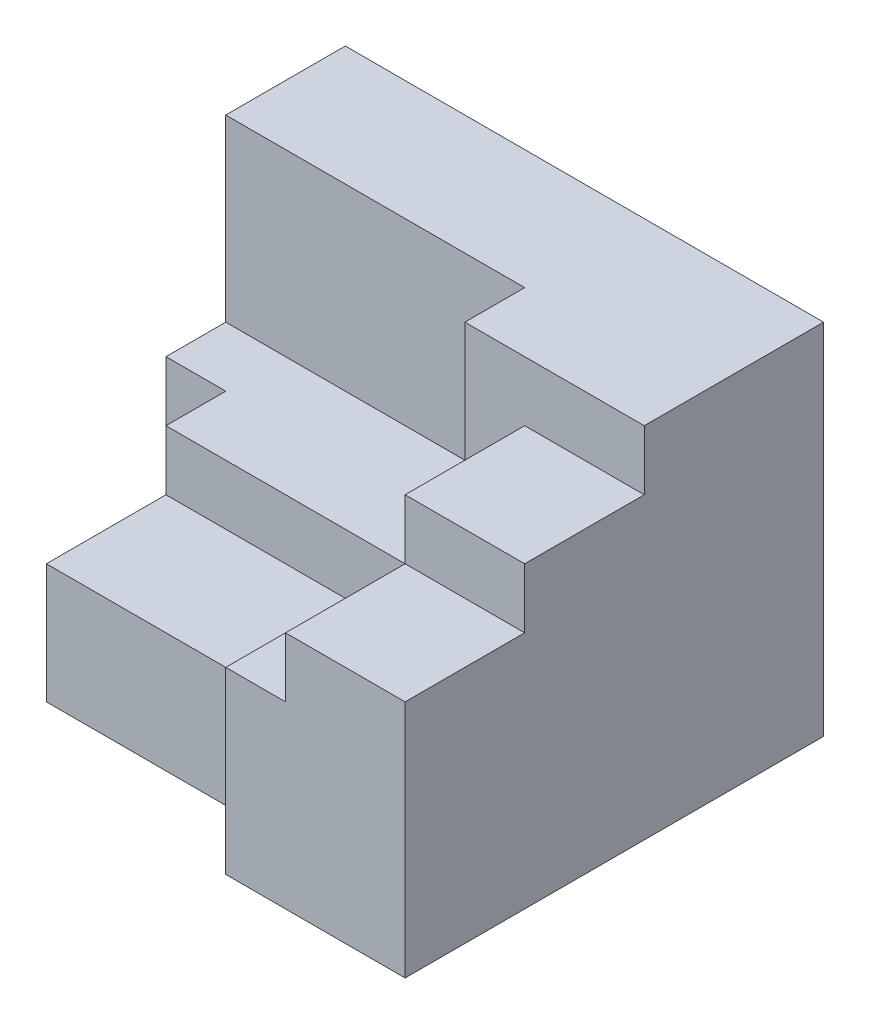
ISO-10303-21;
HEADER;
FILE_DESCRIPTION(('STEP AP214'),'2;1');
FILE_NAME('part.step','',(''),(''),'','','');
FILE_SCHEMA(('AUTOMOTIVE_DESIGN { 1 0 10303 214 1 1 1 1 }'));
ENDSEC;
DATA;
#1=APPLICATION_CONTEXT('core data for automotive mechanical design processes');
#2=APPLICATION_PROTOCOL_DEFINITION('international standard','automotive_design',2000,#1);
#3=PRODUCT_CONTEXT('',#1,'mechanical');
#4=PRODUCT('Part','Part','',(#3));
#5=PRODUCT_RELATED_PRODUCT_CATEGORY('part','',(#4));
#6=PRODUCT_DEFINITION_FORMATION('','',#4);
#7=PRODUCT_DEFINITION_CONTEXT('part definition',#1,'design');
#8=PRODUCT_DEFINITION('design','',#6,#7);
#9=PRODUCT_DEFINITION_SHAPE('','',#8);
#10=(LENGTH_UNIT() NAMED_UNIT(*) SI_UNIT(.MILLI.,.METRE.));
#11=(NAMED_UNIT(*) PLANE_ANGLE_UNIT() SI_UNIT($,.RADIAN.));
#12=(NAMED_UNIT(*) SI_UNIT($,.STERADIAN.) SOLID_ANGLE_UNIT());
#13=UNCERTAINTY_MEASURE_WITH_UNIT(LENGTH_MEASURE(1.E-05),#10,'distance_accuracy_value','');
#14=(GEOMETRIC_REPRESENTATION_CONTEXT(3) GLOBAL_UNCERTAINTY_ASSIGNED_CONTEXT((#13)) GLOBAL_UNIT_ASSIGNED_CONTEXT((#10,
#11,#12)) REPRESENTATION_CONTEXT('',''));
#15=CARTESIAN_POINT('',(0.,0.,0.));
#16=DIRECTION('',(0.,0.,1.));
#17=DIRECTION('',(1.,0.,0.));
#18=AXIS2_PLACEMENT_3D('',#15,#16,#17);
#19=CARTESIAN_POINT('',(-4.,6.,3.50000000000002));
#20=DIRECTION('',(0.,0.,-1.));
#21=DIRECTION('',(-1.,0.,0.));
#22=AXIS2_PLACEMENT_3D('',#19,#20,#21);
#23=PLANE('',#22);
#24=DIRECTION('',(0.,-1.,0.));
#25=VECTOR('',#24,1.);
#26=CARTESIAN_POINT('',(4.,6.,3.50000000000002));
#27=LINE('',#26,#25);
#28=CARTESIAN_POINT('',(4.,4.,3.50000000000002));
#29=VERTEX_POINT('',#28);
#30=CARTESIAN_POINT('',(4.,0.,3.50000000000002));
#31=VERTEX_POINT('',#30);
#32=EDGE_CURVE('E175',#29,#31,#27,.T.);
#33=ORIENTED_EDGE('',*,*,#32,.F.);
#34=DIRECTION('',(1.,0.,0.));
#35=VECTOR('',#34,1.);
#36=CARTESIAN_POINT('',(2.,4.,3.50000000000002));
#37=LINE('',#36,#35);
#38=CARTESIAN_POINT('',(2.,4.,3.50000000000002));
#39=VERTEX_POINT('',#38);
#40=EDGE_CURVE('E161',#39,#29,#37,.T.);
#41=ORIENTED_EDGE('',*,*,#40,.F.);
#42=DIRECTION('',(0.,-1.,0.));
#43=VECTOR('',#42,1.);
#44=CARTESIAN_POINT('',(2.,6.,3.50000000000002));
#45=LINE('',#44,#43);
#46=CARTESIAN_POINT('',(2.,3.,3.50000000000002));
#47=VERTEX_POINT('',#46);
#48=EDGE_CURVE('E172',#39,#47,#45,.T.);
#49=ORIENTED_EDGE('',*,*,#48,.T.);
#50=DIRECTION('',(-1.,0.,0.));
#51=VECTOR('',#50,1.);
#52=CARTESIAN_POINT('',(-4.,3.,3.50000000000002));
#53=LINE('',#52,#51);
#54=CARTESIAN_POINT('',(1.,3.,3.50000000000002));
#55=VERTEX_POINT('',#54);
#56=EDGE_CURVE('E183',#47,#55,#53,.T.);
#57=ORIENTED_EDGE('',*,*,#56,.T.);
#58=DIRECTION('',(0.,1.,0.));
#59=VECTOR('',#58,1.);
#60=CARTESIAN_POINT('',(1.,-54.,3.50000000000002));
#61=LINE('',#60,#59);
#62=CARTESIAN_POINT('',(1.,0.,3.50000000000002));
#63=VERTEX_POINT('',#62);
#64=EDGE_CURVE('E182',#63,#55,#61,.T.);
#65=ORIENTED_EDGE('',*,*,#64,.F.);
#66=DIRECTION('',(1.,0.,0.));
#67=VECTOR('',#66,1.);
#68=CARTESIAN_POINT('',(-4.,0.,3.50000000000002));
#69=LINE('',#68,#67);
#70=EDGE_CURVE('E205',#63,#31,#69,.T.);
#71=ORIENTED_EDGE('',*,*,#70,.T.);
#72=EDGE_LOOP('',(#33,#41,#49,#57,#65,#71));
#73=FACE_BOUND('',#72,.T.);
#74=ADVANCED_FACE('F33',(#73),#23,.F.);
#75=CARTESIAN_POINT('',(2.,3.,-0.499999999999989));
#76=DIRECTION('',(1.,0.,0.));
#77=DIRECTION('',(0.,0.,-1.));
#78=AXIS2_PLACEMENT_3D('',#75,#76,#77);
#79=PLANE('',#78);
#80=DIRECTION('',(0.,0.,1.));
#81=VECTOR('',#80,1.);
#82=CARTESIAN_POINT('',(2.,4.,3.50000000000002));
#83=LINE('',#82,#81);
#84=CARTESIAN_POINT('',(2.,4.,1.50000000000002));
#85=VERTEX_POINT('',#84);
#86=EDGE_CURVE('E158',#85,#39,#83,.T.);
#87=ORIENTED_EDGE('',*,*,#86,.F.);
#88=DIRECTION('',(0.,1.,0.));
#89=VECTOR('',#88,1.);
#90=CARTESIAN_POINT('',(2.,4.,1.50000000000002));
#91=LINE('',#90,#89);
#92=CARTESIAN_POINT('',(2.,5.,1.50000000000002));
#93=VERTEX_POINT('',#92);
#94=EDGE_CURVE('E494',#85,#93,#91,.T.);
#95=ORIENTED_EDGE('',*,*,#94,.T.);
#96=DIRECTION('',(0.,0.,1.));
#97=VECTOR('',#96,1.);
#98=CARTESIAN_POINT('',(2.,5.,-0.499999999999989));
#99=LINE('',#98,#97);
#100=CARTESIAN_POINT('',(2.,5.,-0.499999999999989));
#101=VERTEX_POINT('',#100);
#102=EDGE_CURVE('E489',#101,#93,#99,.T.);
#103=ORIENTED_EDGE('',*,*,#102,.F.);
#104=DIRECTION('',(0.,1.,0.));
#105=VECTOR('',#104,1.);
#106=CARTESIAN_POINT('',(2.,3.,-0.499999999999989));
#107=LINE('',#106,#105);
#108=CARTESIAN_POINT('',(2.,3.,-0.499999999999989));
#109=VERTEX_POINT('',#108);
#110=EDGE_CURVE('E290',#109,#101,#107,.T.);
#111=ORIENTED_EDGE('',*,*,#110,.F.);
#112=DIRECTION('',(0.,0.,-1.));
#113=VECTOR('',#112,1.);
#114=CARTESIAN_POINT('',(2.,3.,-0.499999999999989));
#115=LINE('',#114,#113);
#116=EDGE_CURVE('E181',#47,#109,#115,.T.);
#117=ORIENTED_EDGE('',*,*,#116,.F.);
#118=ORIENTED_EDGE('',*,*,#48,.F.);
#119=EDGE_LOOP('',(#87,#95,#103,#111,#117,#118));
#120=FACE_BOUND('',#119,.T.);
#121=ADVANCED_FACE('F179',(#120),#79,.F.);
#122=CARTESIAN_POINT('',(4.,6.,3.50000000000002));
#123=DIRECTION('',(-1.,0.,0.));
#124=DIRECTION('',(0.,0.,1.));
#125=AXIS2_PLACEMENT_3D('',#122,#123,#124);
#126=PLANE('',#125);
#127=DIRECTION('',(0.,0.,-1.));
#128=VECTOR('',#127,1.);
#129=CARTESIAN_POINT('',(4.,5.,3.50000000000002));
#130=LINE('',#129,#128);
#131=CARTESIAN_POINT('',(4.,5.,1.50000000000002));
#132=VERTEX_POINT('',#131);
#133=CARTESIAN_POINT('',(4.,5.,-0.499999999999989));
#134=VERTEX_POINT('',#133);
#135=EDGE_CURVE('E486',#132,#134,#130,.T.);
#136=ORIENTED_EDGE('',*,*,#135,.F.);
#137=DIRECTION('',(0.,1.,0.));
#138=VECTOR('',#137,1.);
#139=CARTESIAN_POINT('',(4.,4.,1.50000000000002));
#140=LINE('',#139,#138);
#141=CARTESIAN_POINT('',(4.,4.,1.50000000000002));
#142=VERTEX_POINT('',#141);
#143=EDGE_CURVE('E48',#142,#132,#140,.T.);
#144=ORIENTED_EDGE('',*,*,#143,.F.);
#145=DIRECTION('',(0.,0.,-1.));
#146=VECTOR('',#145,1.);
#147=CARTESIAN_POINT('',(4.,4.,3.50000000000002));
#148=LINE('',#147,#146);
#149=EDGE_CURVE('E176',#29,#142,#148,.T.);
#150=ORIENTED_EDGE('',*,*,#149,.F.);
#151=ORIENTED_EDGE('',*,*,#32,.T.);
#152=DIRECTION('',(0.,0.,-1.));
#153=VECTOR('',#152,1.);
#154=CARTESIAN_POINT('',(4.,0.,3.50000000000002));
#155=LINE('',#154,#153);
#156=CARTESIAN_POINT('',(4.,0.,-3.49999999999999));
#157=VERTEX_POINT('',#156);
#158=EDGE_CURVE('E194',#31,#157,#155,.T.);
#159=ORIENTED_EDGE('',*,*,#158,.T.);
#160=DIRECTION('',(0.,-1.,0.));
#161=VECTOR('',#160,1.);
#162=CARTESIAN_POINT('',(4.,6.,-3.49999999999999));
#163=LINE('',#162,#161);
#164=CARTESIAN_POINT('',(4.,6.,-3.49999999999999));
#165=VERTEX_POINT('',#164);
#166=EDGE_CURVE('E222',#165,#157,#163,.T.);
#167=ORIENTED_EDGE('',*,*,#166,.F.);
#168=DIRECTION('',(0.,0.,-1.));
#169=VECTOR('',#168,1.);
#170=CARTESIAN_POINT('',(4.,6.,3.50000000000002));
#171=LINE('',#170,#169);
#172=CARTESIAN_POINT('',(4.,6.,-0.499999999999989));
#173=VERTEX_POINT('',#172);
#174=EDGE_CURVE('E202',#173,#165,#171,.T.);
#175=ORIENTED_EDGE('',*,*,#174,.F.);
#176=DIRECTION('',(0.,-1.,0.));
#177=VECTOR('',#176,1.);
#178=CARTESIAN_POINT('',(4.,6.,-0.499999999999989));
#179=LINE('',#178,#177);
#180=EDGE_CURVE('E263',#173,#134,#179,.T.);
#181=ORIENTED_EDGE('',*,*,#180,.T.);
#182=EDGE_LOOP('',(#136,#144,#150,#151,#159,#167,#175,#181));
#183=FACE_BOUND('',#182,.T.);
#184=ADVANCED_FACE('F35',(#183),#126,.F.);
#185=CARTESIAN_POINT('',(-4.,6.,-3.49999999999999));
#186=DIRECTION('',(0.,0.,1.));
#187=DIRECTION('',(1.,0.,0.));
#188=AXIS2_PLACEMENT_3D('',#185,#186,#187);
#189=PLANE('',#188);
#190=DIRECTION('',(-1.,0.,0.));
#191=VECTOR('',#190,1.);
#192=CARTESIAN_POINT('',(-4.,0.,-3.49999999999999));
#193=LINE('',#192,#191);
#194=CARTESIAN_POINT('',(-4.,0.,-3.49999999999999));
#195=VERTEX_POINT('',#194);
#196=EDGE_CURVE('E212',#157,#195,#193,.T.);
#197=ORIENTED_EDGE('',*,*,#196,.T.);
#198=DIRECTION('',(0.,-1.,0.));
#199=VECTOR('',#198,1.);
#200=CARTESIAN_POINT('',(-4.,6.,-3.49999999999999));
#201=LINE('',#200,#199);
#202=CARTESIAN_POINT('',(-4.,6.,-3.49999999999999));
#203=VERTEX_POINT('',#202);
#204=EDGE_CURVE('E219',#203,#195,#201,.T.);
#205=ORIENTED_EDGE('',*,*,#204,.F.);
#206=DIRECTION('',(-1.,0.,0.));
#207=VECTOR('',#206,1.);
#208=CARTESIAN_POINT('',(-4.,6.,-3.49999999999999));
#209=LINE('',#208,#207);
#210=EDGE_CURVE('E204',#165,#203,#209,.T.);
#211=ORIENTED_EDGE('',*,*,#210,.F.);
#212=ORIENTED_EDGE('',*,*,#166,.T.);
#213=EDGE_LOOP('',(#197,#205,#211,#212));
#214=FACE_BOUND('',#213,.T.);
#215=ADVANCED_FACE('F316',(#214),#189,.F.);
#216=CARTESIAN_POINT('',(-4.,6.,3.50000000000002));
#217=DIRECTION('',(1.,0.,0.));
#218=DIRECTION('',(0.,0.,-1.));
#219=AXIS2_PLACEMENT_3D('',#216,#217,#218);
#220=PLANE('',#219);
#221=DIRECTION('',(0.,0.,1.));
#222=VECTOR('',#221,1.);
#223=CARTESIAN_POINT('',(-4.,3.,3.68950832365466));
#224=LINE('',#223,#222);
#225=CARTESIAN_POINT('',(-4.,3.,-1.49999999999999));
#226=VERTEX_POINT('',#225);
#227=CARTESIAN_POINT('',(-4.,3.,-0.499999999999984));
#228=VERTEX_POINT('',#227);
#229=EDGE_CURVE('E277',#226,#228,#224,.T.);
#230=ORIENTED_EDGE('',*,*,#229,.F.);
#231=DIRECTION('',(0.,1.,0.));
#232=VECTOR('',#231,1.);
#233=CARTESIAN_POINT('',(-4.,3.,-1.49999999999999));
#234=LINE('',#233,#232);
#235=CARTESIAN_POINT('',(-4.,6.,-1.49999999999999));
#236=VERTEX_POINT('',#235);
#237=EDGE_CURVE('E297',#226,#236,#234,.T.);
#238=ORIENTED_EDGE('',*,*,#237,.T.);
#239=DIRECTION('',(0.,0.,1.));
#240=VECTOR('',#239,1.);
#241=CARTESIAN_POINT('',(-4.,6.,3.50000000000002));
#242=LINE('',#241,#240);
#243=EDGE_CURVE('E207',#203,#236,#242,.T.);
#244=ORIENTED_EDGE('',*,*,#243,.F.);
#245=ORIENTED_EDGE('',*,*,#204,.T.);
#246=DIRECTION('',(0.,0.,1.));
#247=VECTOR('',#246,1.);
#248=CARTESIAN_POINT('',(-4.,0.,3.50000000000002));
#249=LINE('',#248,#247);
#250=CARTESIAN_POINT('',(-4.,0.,-0.499999999999983));
#251=VERTEX_POINT('',#250);
#252=EDGE_CURVE('E214',#195,#251,#249,.T.);
#253=ORIENTED_EDGE('',*,*,#252,.T.);
#254=DIRECTION('',(0.,1.,0.));
#255=VECTOR('',#254,1.);
#256=CARTESIAN_POINT('',(-4.,-54.,-0.499999999999983));
#257=LINE('',#256,#255);
#258=EDGE_CURVE('E191',#251,#228,#257,.T.);
#259=ORIENTED_EDGE('',*,*,#258,.T.);
#260=EDGE_LOOP('',(#230,#238,#244,#245,#253,#259));
#261=FACE_BOUND('',#260,.T.);
#262=ADVANCED_FACE('F309',(#261),#220,.F.);
#263=CARTESIAN_POINT('',(0.,6.,0.));
#264=DIRECTION('',(0.,-1.,0.));
#265=DIRECTION('',(0.,0.,-1.));
#266=AXIS2_PLACEMENT_3D('',#263,#264,#265);
#267=PLANE('',#266);
#268=DIRECTION('',(-1.,0.,0.));
#269=VECTOR('',#268,1.);
#270=CARTESIAN_POINT('',(1.,6.,-0.499999999999989));
#271=LINE('',#270,#269);
#272=CARTESIAN_POINT('',(1.,6.,-0.499999999999989));
#273=VERTEX_POINT('',#272);
#274=EDGE_CURVE('E274',#173,#273,#271,.T.);
#275=ORIENTED_EDGE('',*,*,#274,.F.);
#276=ORIENTED_EDGE('',*,*,#174,.T.);
#277=ORIENTED_EDGE('',*,*,#210,.T.);
#278=ORIENTED_EDGE('',*,*,#243,.T.);
#279=DIRECTION('',(-1.,0.,0.));
#280=VECTOR('',#279,1.);
#281=CARTESIAN_POINT('',(-4.,6.,-1.49999999999999));
#282=LINE('',#281,#280);
#283=CARTESIAN_POINT('',(1.,6.,-1.49999999999999));
#284=VERTEX_POINT('',#283);
#285=EDGE_CURVE('E279',#284,#236,#282,.T.);
#286=ORIENTED_EDGE('',*,*,#285,.F.);
#287=DIRECTION('',(0.,0.,-1.));
#288=VECTOR('',#287,1.);
#289=CARTESIAN_POINT('',(1.,6.,-1.49999999999999));
#290=LINE('',#289,#288);
#291=EDGE_CURVE('E293',#273,#284,#290,.T.);
#292=ORIENTED_EDGE('',*,*,#291,.F.);
#293=EDGE_LOOP('',(#275,#276,#277,#278,#286,#292));
#294=FACE_BOUND('',#293,.T.);
#295=ADVANCED_FACE('F349',(#294),#267,.F.);
#296=CARTESIAN_POINT('',(0.,0.,0.));
#297=DIRECTION('',(0.,-1.,0.));
#298=DIRECTION('',(0.,0.,-1.));
#299=AXIS2_PLACEMENT_3D('',#296,#297,#298);
#300=PLANE('',#299);
#301=DIRECTION('',(1.,0.,0.));
#302=VECTOR('',#301,1.);
#303=CARTESIAN_POINT('',(0.,0.,-0.499999999999983));
#304=LINE('',#303,#302);
#305=CARTESIAN_POINT('',(-3.,0.,-0.499999999999983));
#306=VERTEX_POINT('',#305);
#307=EDGE_CURVE('E41',#251,#306,#304,.T.);
#308=ORIENTED_EDGE('',*,*,#307,.F.);
#309=ORIENTED_EDGE('',*,*,#252,.F.);
#310=ORIENTED_EDGE('',*,*,#196,.F.);
#311=ORIENTED_EDGE('',*,*,#158,.F.);
#312=ORIENTED_EDGE('',*,*,#70,.F.);
#313=DIRECTION('',(0.,0.,1.));
#314=VECTOR('',#313,1.);
#315=CARTESIAN_POINT('',(1.,0.,0.));
#316=LINE('',#315,#314);
#317=CARTESIAN_POINT('',(1.,0.,2.50000000000002));
#318=VERTEX_POINT('',#317);
#319=EDGE_CURVE('E225',#318,#63,#316,.T.);
#320=ORIENTED_EDGE('',*,*,#319,.F.);
#321=DIRECTION('',(1.,0.,0.));
#322=VECTOR('',#321,1.);
#323=CARTESIAN_POINT('',(0.,0.,2.50000000000002));
#324=LINE('',#323,#322);
#325=CARTESIAN_POINT('',(-3.,0.,2.50000000000002));
#326=VERTEX_POINT('',#325);
#327=EDGE_CURVE('E227',#326,#318,#324,.T.);
#328=ORIENTED_EDGE('',*,*,#327,.F.);
#329=DIRECTION('',(0.,0.,1.));
#330=VECTOR('',#329,1.);
#331=CARTESIAN_POINT('',(-3.,0.,0.));
#332=LINE('',#331,#330);
#333=EDGE_CURVE('E229',#306,#326,#332,.T.);
#334=ORIENTED_EDGE('',*,*,#333,.F.);
#335=EDGE_LOOP('',(#308,#309,#310,#311,#312,#320,#328,#334));
#336=FACE_BOUND('',#335,.T.);
#337=ADVANCED_FACE('F247',(#336),#300,.T.);
#338=CARTESIAN_POINT('',(-4.,-54.,-0.499999999999983));
#339=DIRECTION('',(0.,0.,-1.));
#340=DIRECTION('',(-1.,0.,0.));
#341=AXIS2_PLACEMENT_3D('',#338,#339,#340);
#342=PLANE('',#341);
#343=DIRECTION('',(0.,1.,0.));
#344=VECTOR('',#343,1.);
#345=CARTESIAN_POINT('',(-3.,-54.,-0.499999999999983));
#346=LINE('',#345,#344);
#347=CARTESIAN_POINT('',(-3.,3.,-0.499999999999983));
#348=VERTEX_POINT('',#347);
#349=EDGE_CURVE('E195',#306,#348,#346,.T.);
#350=ORIENTED_EDGE('',*,*,#349,.T.);
#351=DIRECTION('',(-1.,0.,0.));
#352=VECTOR('',#351,1.);
#353=CARTESIAN_POINT('',(-4.,3.,-0.499999999999983));
#354=LINE('',#353,#352);
#355=EDGE_CURVE('E187',#348,#228,#354,.T.);
#356=ORIENTED_EDGE('',*,*,#355,.T.);
#357=ORIENTED_EDGE('',*,*,#258,.F.);
#358=ORIENTED_EDGE('',*,*,#307,.T.);
#359=EDGE_LOOP('',(#350,#356,#357,#358));
#360=FACE_BOUND('',#359,.T.);
#361=ADVANCED_FACE('F233',(#360),#342,.F.);
#362=CARTESIAN_POINT('',(-3.,-54.,-0.499999999999983));
#363=DIRECTION('',(1.,0.,0.));
#364=DIRECTION('',(0.,0.,-1.));
#365=AXIS2_PLACEMENT_3D('',#362,#363,#364);
#366=PLANE('',#365);
#367=DIRECTION('',(0.,0.,1.));
#368=VECTOR('',#367,1.);
#369=CARTESIAN_POINT('',(-3.,2.,2.50000000000002));
#370=LINE('',#369,#368);
#371=CARTESIAN_POINT('',(-3.,2.,0.500000000000017));
#372=VERTEX_POINT('',#371);
#373=CARTESIAN_POINT('',(-3.,2.,2.50000000000002));
#374=VERTEX_POINT('',#373);
#375=EDGE_CURVE('E255',#372,#374,#370,.T.);
#376=ORIENTED_EDGE('',*,*,#375,.F.);
#377=DIRECTION('',(0.,1.,0.));
#378=VECTOR('',#377,1.);
#379=CARTESIAN_POINT('',(-3.,2.,0.500000000000017));
#380=LINE('',#379,#378);
#381=CARTESIAN_POINT('',(-3.,3.,0.500000000000017));
#382=VERTEX_POINT('',#381);
#383=EDGE_CURVE('E256',#372,#382,#380,.T.);
#384=ORIENTED_EDGE('',*,*,#383,.T.);
#385=DIRECTION('',(0.,0.,-1.));
#386=VECTOR('',#385,1.);
#387=CARTESIAN_POINT('',(-3.,3.,-0.499999999999983));
#388=LINE('',#387,#386);
#389=EDGE_CURVE('E244',#382,#348,#388,.T.);
#390=ORIENTED_EDGE('',*,*,#389,.T.);
#391=ORIENTED_EDGE('',*,*,#349,.F.);
#392=ORIENTED_EDGE('',*,*,#333,.T.);
#393=DIRECTION('',(0.,1.,0.));
#394=VECTOR('',#393,1.);
#395=CARTESIAN_POINT('',(-3.,-54.,2.50000000000002));
#396=LINE('',#395,#394);
#397=EDGE_CURVE('E198',#326,#374,#396,.T.);
#398=ORIENTED_EDGE('',*,*,#397,.T.);
#399=EDGE_LOOP('',(#376,#384,#390,#391,#392,#398));
#400=FACE_BOUND('',#399,.T.);
#401=ADVANCED_FACE('F240',(#400),#366,.F.);
#402=CARTESIAN_POINT('',(-3.,-54.,2.50000000000002));
#403=DIRECTION('',(0.,0.,-1.));
#404=DIRECTION('',(-1.,0.,0.));
#405=AXIS2_PLACEMENT_3D('',#402,#403,#404);
#406=PLANE('',#405);
#407=DIRECTION('',(0.,1.,0.));
#408=VECTOR('',#407,1.);
#409=CARTESIAN_POINT('',(1.,-54.,2.50000000000002));
#410=LINE('',#409,#408);
#411=CARTESIAN_POINT('',(1.,2.,2.50000000000002));
#412=VERTEX_POINT('',#411);
#413=EDGE_CURVE('E56',#318,#412,#410,.T.);
#414=ORIENTED_EDGE('',*,*,#413,.T.);
#415=DIRECTION('',(1.,0.,0.));
#416=VECTOR('',#415,1.);
#417=CARTESIAN_POINT('',(-3.,2.,2.50000000000002));
#418=LINE('',#417,#416);
#419=EDGE_CURVE('E254',#374,#412,#418,.T.);
#420=ORIENTED_EDGE('',*,*,#419,.F.);
#421=ORIENTED_EDGE('',*,*,#397,.F.);
#422=ORIENTED_EDGE('',*,*,#327,.T.);
#423=EDGE_LOOP('',(#414,#420,#421,#422));
#424=FACE_BOUND('',#423,.T.);
#425=ADVANCED_FACE('F251',(#424),#406,.F.);
#426=CARTESIAN_POINT('',(1.,-54.,2.50000000000002));
#427=DIRECTION('',(1.,0.,0.));
#428=DIRECTION('',(0.,0.,-1.));
#429=AXIS2_PLACEMENT_3D('',#426,#427,#428);
#430=PLANE('',#429);
#431=ORIENTED_EDGE('',*,*,#64,.T.);
#432=DIRECTION('',(0.,0.,-1.));
#433=VECTOR('',#432,1.);
#434=CARTESIAN_POINT('',(1.,3.,2.50000000000002));
#435=LINE('',#434,#433);
#436=CARTESIAN_POINT('',(1.,3.,0.500000000000017));
#437=VERTEX_POINT('',#436);
#438=EDGE_CURVE('E11',#55,#437,#435,.T.);
#439=ORIENTED_EDGE('',*,*,#438,.T.);
#440=DIRECTION('',(0.,1.,0.));
#441=VECTOR('',#440,1.);
#442=CARTESIAN_POINT('',(1.,2.,0.500000000000017));
#443=LINE('',#442,#441);
#444=CARTESIAN_POINT('',(1.,2.,0.500000000000017));
#445=VERTEX_POINT('',#444);
#446=EDGE_CURVE('E271',#445,#437,#443,.T.);
#447=ORIENTED_EDGE('',*,*,#446,.F.);
#448=DIRECTION('',(0.,0.,-1.));
#449=VECTOR('',#448,1.);
#450=CARTESIAN_POINT('',(1.,2.,2.50000000000002));
#451=LINE('',#450,#449);
#452=EDGE_CURVE('E261',#412,#445,#451,.T.);
#453=ORIENTED_EDGE('',*,*,#452,.F.);
#454=ORIENTED_EDGE('',*,*,#413,.F.);
#455=ORIENTED_EDGE('',*,*,#319,.T.);
#456=EDGE_LOOP('',(#431,#439,#447,#453,#454,#455));
#457=FACE_BOUND('',#456,.T.);
#458=ADVANCED_FACE('F321',(#457),#430,.F.);
#459=CARTESIAN_POINT('',(0.,3.,0.));
#460=DIRECTION('',(0.,-1.,0.));
#461=DIRECTION('',(0.,0.,-1.));
#462=AXIS2_PLACEMENT_3D('',#459,#460,#461);
#463=PLANE('',#462);
#464=ORIENTED_EDGE('',*,*,#389,.F.);
#465=DIRECTION('',(-1.,0.,0.));
#466=VECTOR('',#465,1.);
#467=CARTESIAN_POINT('',(-3.,3.,0.500000000000017));
#468=LINE('',#467,#466);
#469=EDGE_CURVE('E259',#437,#382,#468,.T.);
#470=ORIENTED_EDGE('',*,*,#469,.F.);
#471=ORIENTED_EDGE('',*,*,#438,.F.);
#472=ORIENTED_EDGE('',*,*,#56,.F.);
#473=ORIENTED_EDGE('',*,*,#116,.T.);
#474=DIRECTION('',(-1.,0.,0.));
#475=VECTOR('',#474,1.);
#476=CARTESIAN_POINT('',(1.,3.,-0.499999999999989));
#477=LINE('',#476,#475);
#478=CARTESIAN_POINT('',(1.,3.,-0.499999999999989));
#479=VERTEX_POINT('',#478);
#480=EDGE_CURVE('E281',#109,#479,#477,.T.);
#481=ORIENTED_EDGE('',*,*,#480,.T.);
#482=DIRECTION('',(0.,0.,-1.));
#483=VECTOR('',#482,1.);
#484=CARTESIAN_POINT('',(1.,3.,-1.49999999999999));
#485=LINE('',#484,#483);
#486=CARTESIAN_POINT('',(1.,3.,-1.49999999999999));
#487=VERTEX_POINT('',#486);
#488=EDGE_CURVE('E284',#479,#487,#485,.T.);
#489=ORIENTED_EDGE('',*,*,#488,.T.);
#490=DIRECTION('',(-1.,0.,0.));
#491=VECTOR('',#490,1.);
#492=CARTESIAN_POINT('',(-4.,3.,-1.49999999999999));
#493=LINE('',#492,#491);
#494=EDGE_CURVE('E287',#487,#226,#493,.T.);
#495=ORIENTED_EDGE('',*,*,#494,.T.);
#496=ORIENTED_EDGE('',*,*,#229,.T.);
#497=ORIENTED_EDGE('',*,*,#355,.F.);
#498=EDGE_LOOP('',(#464,#470,#471,#472,#473,#481,#489,#495,#496,#497));
#499=FACE_BOUND('',#498,.T.);
#500=ADVANCED_FACE('F326',(#499),#463,.F.);
#501=CARTESIAN_POINT('',(-4.,3.,-1.49999999999999));
#502=DIRECTION('',(0.,0.,-1.));
#503=DIRECTION('',(-1.,0.,0.));
#504=AXIS2_PLACEMENT_3D('',#501,#502,#503);
#505=PLANE('',#504);
#506=ORIENTED_EDGE('',*,*,#285,.T.);
#507=ORIENTED_EDGE('',*,*,#237,.F.);
#508=ORIENTED_EDGE('',*,*,#494,.F.);
#509=DIRECTION('',(0.,1.,0.));
#510=VECTOR('',#509,1.);
#511=CARTESIAN_POINT('',(1.,3.,-1.49999999999999));
#512=LINE('',#511,#510);
#513=EDGE_CURVE('E300',#487,#284,#512,.T.);
#514=ORIENTED_EDGE('',*,*,#513,.T.);
#515=EDGE_LOOP('',(#506,#507,#508,#514));
#516=FACE_BOUND('',#515,.T.);
#517=ADVANCED_FACE('F328',(#516),#505,.F.);
#518=CARTESIAN_POINT('',(1.,3.,-1.49999999999999));
#519=DIRECTION('',(1.,0.,0.));
#520=DIRECTION('',(0.,0.,-1.));
#521=AXIS2_PLACEMENT_3D('',#518,#519,#520);
#522=PLANE('',#521);
#523=ORIENTED_EDGE('',*,*,#291,.T.);
#524=ORIENTED_EDGE('',*,*,#513,.F.);
#525=ORIENTED_EDGE('',*,*,#488,.F.);
#526=DIRECTION('',(0.,1.,0.));
#527=VECTOR('',#526,1.);
#528=CARTESIAN_POINT('',(1.,3.,-0.499999999999989));
#529=LINE('',#528,#527);
#530=EDGE_CURVE('E302',#479,#273,#529,.T.);
#531=ORIENTED_EDGE('',*,*,#530,.T.);
#532=EDGE_LOOP('',(#523,#524,#525,#531));
#533=FACE_BOUND('',#532,.T.);
#534=ADVANCED_FACE('F334',(#533),#522,.F.);
#535=CARTESIAN_POINT('',(1.,3.,-0.499999999999989));
#536=DIRECTION('',(0.,0.,-1.));
#537=DIRECTION('',(-1.,0.,0.));
#538=AXIS2_PLACEMENT_3D('',#535,#536,#537);
#539=PLANE('',#538);
#540=ORIENTED_EDGE('',*,*,#274,.T.);
#541=ORIENTED_EDGE('',*,*,#530,.F.);
#542=ORIENTED_EDGE('',*,*,#480,.F.);
#543=ORIENTED_EDGE('',*,*,#110,.T.);
#544=DIRECTION('',(-1.,0.,0.));
#545=VECTOR('',#544,1.);
#546=CARTESIAN_POINT('',(2.,5.,-0.499999999999989));
#547=LINE('',#546,#545);
#548=EDGE_CURVE('E487',#134,#101,#547,.T.);
#549=ORIENTED_EDGE('',*,*,#548,.F.);
#550=ORIENTED_EDGE('',*,*,#180,.F.);
#551=EDGE_LOOP('',(#540,#541,#542,#543,#549,#550));
#552=FACE_BOUND('',#551,.T.);
#553=ADVANCED_FACE('F372',(#552),#539,.F.);
#554=CARTESIAN_POINT('',(-3.,2.,0.500000000000017));
#555=DIRECTION('',(0.,0.,-1.));
#556=DIRECTION('',(-1.,0.,0.));
#557=AXIS2_PLACEMENT_3D('',#554,#555,#556);
#558=PLANE('',#557);
#559=ORIENTED_EDGE('',*,*,#469,.T.);
#560=ORIENTED_EDGE('',*,*,#383,.F.);
#561=DIRECTION('',(-1.,0.,0.));
#562=VECTOR('',#561,1.);
#563=CARTESIAN_POINT('',(-3.,2.,0.500000000000017));
#564=LINE('',#563,#562);
#565=EDGE_CURVE('E270',#445,#372,#564,.T.);
#566=ORIENTED_EDGE('',*,*,#565,.F.);
#567=ORIENTED_EDGE('',*,*,#446,.T.);
#568=EDGE_LOOP('',(#559,#560,#566,#567));
#569=FACE_BOUND('',#568,.T.);
#570=ADVANCED_FACE('F325',(#569),#558,.F.);
#571=CARTESIAN_POINT('',(0.,2.,0.));
#572=DIRECTION('',(0.,-1.,0.));
#573=DIRECTION('',(0.,0.,-1.));
#574=AXIS2_PLACEMENT_3D('',#571,#572,#573);
#575=PLANE('',#574);
#576=ORIENTED_EDGE('',*,*,#375,.T.);
#577=ORIENTED_EDGE('',*,*,#419,.T.);
#578=ORIENTED_EDGE('',*,*,#452,.T.);
#579=ORIENTED_EDGE('',*,*,#565,.T.);
#580=EDGE_LOOP('',(#576,#577,#578,#579));
#581=FACE_BOUND('',#580,.T.);
#582=ADVANCED_FACE('F396',(#581),#575,.F.);
#583=CARTESIAN_POINT('',(0.,5.,0.));
#584=DIRECTION('',(0.,1.,0.));
#585=DIRECTION('',(0.,0.,1.));
#586=AXIS2_PLACEMENT_3D('',#583,#584,#585);
#587=PLANE('',#586);
#588=DIRECTION('',(-1.,0.,0.));
#589=VECTOR('',#588,1.);
#590=CARTESIAN_POINT('',(2.,5.,1.50000000000002));
#591=LINE('',#590,#589);
#592=EDGE_CURVE('E167',#132,#93,#591,.T.);
#593=ORIENTED_EDGE('',*,*,#592,.F.);
#594=ORIENTED_EDGE('',*,*,#135,.T.);
#595=ORIENTED_EDGE('',*,*,#548,.T.);
#596=ORIENTED_EDGE('',*,*,#102,.T.);
#597=EDGE_LOOP('',(#593,#594,#595,#596));
#598=FACE_BOUND('',#597,.T.);
#599=ADVANCED_FACE('F400',(#598),#587,.T.);
#600=CARTESIAN_POINT('',(2.,4.,1.50000000000002));
#601=DIRECTION('',(0.,0.,-1.));
#602=DIRECTION('',(-1.,0.,0.));
#603=AXIS2_PLACEMENT_3D('',#600,#601,#602);
#604=PLANE('',#603);
#605=ORIENTED_EDGE('',*,*,#592,.T.);
#606=ORIENTED_EDGE('',*,*,#94,.F.);
#607=DIRECTION('',(-1.,0.,0.));
#608=VECTOR('',#607,1.);
#609=CARTESIAN_POINT('',(2.,4.,1.50000000000002));
#610=LINE('',#609,#608);
#611=EDGE_CURVE('E163',#142,#85,#610,.T.);
#612=ORIENTED_EDGE('',*,*,#611,.F.);
#613=ORIENTED_EDGE('',*,*,#143,.T.);
#614=EDGE_LOOP('',(#605,#606,#612,#613));
#615=FACE_BOUND('',#614,.T.);
#616=ADVANCED_FACE('F499',(#615),#604,.F.);
#617=CARTESIAN_POINT('',(0.,4.,0.));
#618=DIRECTION('',(0.,-1.,0.));
#619=DIRECTION('',(0.,0.,-1.));
#620=AXIS2_PLACEMENT_3D('',#617,#618,#619);
#621=PLANE('',#620);
#622=ORIENTED_EDGE('',*,*,#86,.T.);
#623=ORIENTED_EDGE('',*,*,#40,.T.);
#624=ORIENTED_EDGE('',*,*,#149,.T.);
#625=ORIENTED_EDGE('',*,*,#611,.T.);
#626=EDGE_LOOP('',(#622,#623,#624,#625));
#627=FACE_BOUND('',#626,.T.);
#628=ADVANCED_FACE('F160',(#627),#621,.F.);
#629=CLOSED_SHELL('',(#74,#121,#184,#215,#262,#295,#337,#361,#401,#425,#458,#500,#517,#534,#553,
#570,#582,#599,#616,#628));
#630=MANIFOLD_SOLID_BREP('B2',#629);
#631=ADVANCED_BREP_SHAPE_REPRESENTATION('',(#18,#630),#14);
#632=SHAPE_DEFINITION_REPRESENTATION(#9,#631);
ENDSEC;
END-ISO-10303-21;
